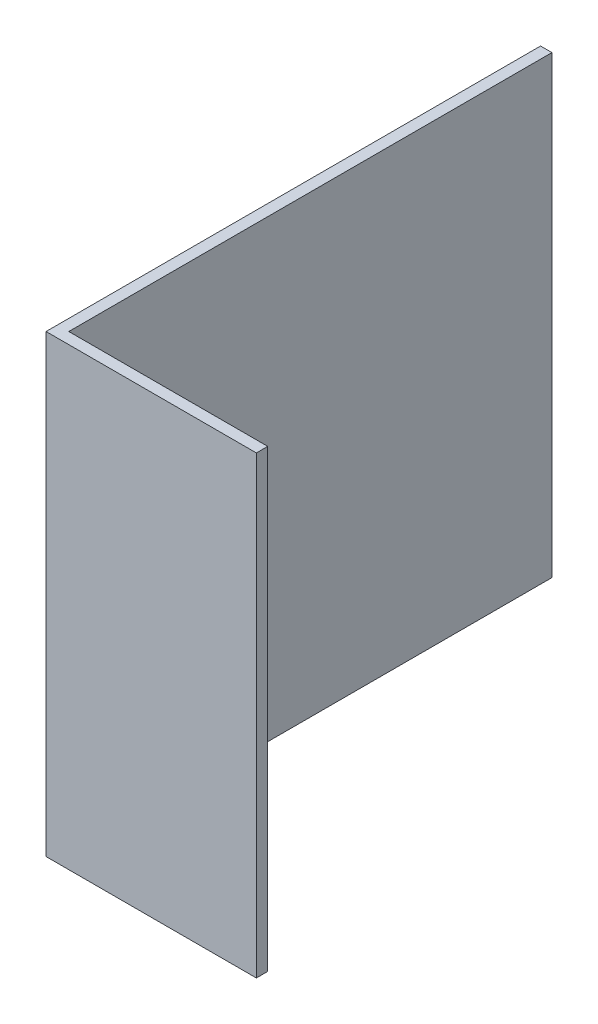
ISO-10303-21;
HEADER;
FILE_DESCRIPTION(('STEP AP214'),'2;1');
FILE_NAME('part.step','',(''),(''),'','','');
FILE_SCHEMA(('AUTOMOTIVE_DESIGN { 1 0 10303 214 1 1 1 1 }'));
ENDSEC;
DATA;
#1=APPLICATION_CONTEXT('core data for automotive mechanical design processes');
#2=APPLICATION_PROTOCOL_DEFINITION('international standard','automotive_design',2000,#1);
#3=PRODUCT_CONTEXT('',#1,'mechanical');
#4=PRODUCT('Part','Part','',(#3));
#5=PRODUCT_RELATED_PRODUCT_CATEGORY('part','',(#4));
#6=PRODUCT_DEFINITION_FORMATION('','',#4);
#7=PRODUCT_DEFINITION_CONTEXT('part definition',#1,'design');
#8=PRODUCT_DEFINITION('design','',#6,#7);
#9=PRODUCT_DEFINITION_SHAPE('','',#8);
#10=(LENGTH_UNIT() NAMED_UNIT(*) SI_UNIT(.MILLI.,.METRE.));
#11=(NAMED_UNIT(*) PLANE_ANGLE_UNIT() SI_UNIT($,.RADIAN.));
#12=(NAMED_UNIT(*) SI_UNIT($,.STERADIAN.) SOLID_ANGLE_UNIT());
#13=UNCERTAINTY_MEASURE_WITH_UNIT(LENGTH_MEASURE(1.E-05),#10,'distance_accuracy_value','');
#14=(GEOMETRIC_REPRESENTATION_CONTEXT(3) GLOBAL_UNCERTAINTY_ASSIGNED_CONTEXT((#13)) GLOBAL_UNIT_ASSIGNED_CONTEXT((#10,
#11,#12)) REPRESENTATION_CONTEXT('',''));
#15=CARTESIAN_POINT('',(0.,0.,0.));
#16=DIRECTION('',(0.,0.,1.));
#17=DIRECTION('',(1.,0.,0.));
#18=AXIS2_PLACEMENT_3D('',#15,#16,#17);
#19=CARTESIAN_POINT('',(0.,40.,0.));
#20=DIRECTION('',(-1.,0.,0.));
#21=DIRECTION('',(0.,0.,1.));
#22=AXIS2_PLACEMENT_3D('',#19,#20,#21);
#23=PLANE('',#22);
#24=DIRECTION('',(0.,1.,0.));
#25=VECTOR('',#24,1.);
#26=CARTESIAN_POINT('',(0.,-40.,-2.));
#27=LINE('',#26,#25);
#28=CARTESIAN_POINT('',(0.,-40.,-2.));
#29=VERTEX_POINT('',#28);
#30=CARTESIAN_POINT('',(0.,40.,-2.));
#31=VERTEX_POINT('',#30);
#32=EDGE_CURVE('E54',#29,#31,#27,.T.);
#33=ORIENTED_EDGE('',*,*,#32,.F.);
#34=DIRECTION('',(0.,0.,-1.));
#35=VECTOR('',#34,1.);
#36=CARTESIAN_POINT('',(0.,-40.,0.));
#37=LINE('',#36,#35);
#38=CARTESIAN_POINT('',(0.,-40.,-87.));
#39=VERTEX_POINT('',#38);
#40=EDGE_CURVE('E107',#29,#39,#37,.T.);
#41=ORIENTED_EDGE('',*,*,#40,.T.);
#42=DIRECTION('',(0.,-1.,0.));
#43=VECTOR('',#42,1.);
#44=CARTESIAN_POINT('',(0.,40.,-87.));
#45=LINE('',#44,#43);
#46=CARTESIAN_POINT('',(0.,40.,-87.));
#47=VERTEX_POINT('',#46);
#48=EDGE_CURVE('E11',#47,#39,#45,.T.);
#49=ORIENTED_EDGE('',*,*,#48,.F.);
#50=DIRECTION('',(0.,0.,-1.));
#51=VECTOR('',#50,1.);
#52=CARTESIAN_POINT('',(0.,40.,0.));
#53=LINE('',#52,#51);
#54=EDGE_CURVE('E83',#31,#47,#53,.T.);
#55=ORIENTED_EDGE('',*,*,#54,.F.);
#56=EDGE_LOOP('',(#33,#41,#49,#55));
#57=FACE_BOUND('',#56,.T.);
#58=ADVANCED_FACE('F37',(#57),#23,.F.);
#59=CARTESIAN_POINT('',(-2.,40.,0.));
#60=DIRECTION('',(0.,0.,-1.));
#61=DIRECTION('',(-1.,0.,0.));
#62=AXIS2_PLACEMENT_3D('',#59,#60,#61);
#63=PLANE('',#62);
#64=DIRECTION('',(1.,0.,0.));
#65=VECTOR('',#64,1.);
#66=CARTESIAN_POINT('',(-2.,-40.,0.));
#67=LINE('',#66,#65);
#68=CARTESIAN_POINT('',(-2.,-40.,0.));
#69=VERTEX_POINT('',#68);
#70=CARTESIAN_POINT('',(35.,-40.,0.));
#71=VERTEX_POINT('',#70);
#72=EDGE_CURVE('E100',#69,#71,#67,.T.);
#73=ORIENTED_EDGE('',*,*,#72,.T.);
#74=DIRECTION('',(0.,-1.,0.));
#75=VECTOR('',#74,1.);
#76=CARTESIAN_POINT('',(35.,40.,0.));
#77=LINE('',#76,#75);
#78=CARTESIAN_POINT('',(35.,40.,0.));
#79=VERTEX_POINT('',#78);
#80=EDGE_CURVE('E104',#79,#71,#77,.T.);
#81=ORIENTED_EDGE('',*,*,#80,.F.);
#82=DIRECTION('',(1.,0.,0.));
#83=VECTOR('',#82,1.);
#84=CARTESIAN_POINT('',(-2.,40.,0.));
#85=LINE('',#84,#83);
#86=CARTESIAN_POINT('',(-2.,40.,0.));
#87=VERTEX_POINT('',#86);
#88=EDGE_CURVE('E130',#87,#79,#85,.T.);
#89=ORIENTED_EDGE('',*,*,#88,.F.);
#90=DIRECTION('',(0.,-1.,0.));
#91=VECTOR('',#90,1.);
#92=CARTESIAN_POINT('',(-2.,40.,0.));
#93=LINE('',#92,#91);
#94=EDGE_CURVE('E105',#87,#69,#93,.T.);
#95=ORIENTED_EDGE('',*,*,#94,.T.);
#96=EDGE_LOOP('',(#73,#81,#89,#95));
#97=FACE_BOUND('',#96,.T.);
#98=ADVANCED_FACE('F39',(#97),#63,.F.);
#99=CARTESIAN_POINT('',(0.,40.,-87.));
#100=DIRECTION('',(0.,0.,1.));
#101=DIRECTION('',(1.,0.,0.));
#102=AXIS2_PLACEMENT_3D('',#99,#100,#101);
#103=PLANE('',#102);
#104=DIRECTION('',(-1.,0.,0.));
#105=VECTOR('',#104,1.);
#106=CARTESIAN_POINT('',(0.,-40.,-87.));
#107=LINE('',#106,#105);
#108=CARTESIAN_POINT('',(-2.00000000000001,-40.,-87.));
#109=VERTEX_POINT('',#108);
#110=EDGE_CURVE('E142',#39,#109,#107,.T.);
#111=ORIENTED_EDGE('',*,*,#110,.T.);
#112=DIRECTION('',(0.,-1.,0.));
#113=VECTOR('',#112,1.);
#114=CARTESIAN_POINT('',(-2.00000000000001,40.,-87.));
#115=LINE('',#114,#113);
#116=CARTESIAN_POINT('',(-2.00000000000001,40.,-87.));
#117=VERTEX_POINT('',#116);
#118=EDGE_CURVE('E46',#117,#109,#115,.T.);
#119=ORIENTED_EDGE('',*,*,#118,.F.);
#120=DIRECTION('',(-1.,0.,0.));
#121=VECTOR('',#120,1.);
#122=CARTESIAN_POINT('',(0.,40.,-87.));
#123=LINE('',#122,#121);
#124=EDGE_CURVE('E141',#47,#117,#123,.T.);
#125=ORIENTED_EDGE('',*,*,#124,.F.);
#126=ORIENTED_EDGE('',*,*,#48,.T.);
#127=EDGE_LOOP('',(#111,#119,#125,#126));
#128=FACE_BOUND('',#127,.T.);
#129=ADVANCED_FACE('F155',(#128),#103,.F.);
#130=CARTESIAN_POINT('',(-2.00000000000001,40.,-87.));
#131=DIRECTION('',(1.,0.,0.));
#132=DIRECTION('',(0.,0.,-1.));
#133=AXIS2_PLACEMENT_3D('',#130,#131,#132);
#134=PLANE('',#133);
#135=DIRECTION('',(0.,0.,1.));
#136=VECTOR('',#135,1.);
#137=CARTESIAN_POINT('',(-2.00000000000001,-40.,-87.));
#138=LINE('',#137,#136);
#139=EDGE_CURVE('E79',#109,#69,#138,.T.);
#140=ORIENTED_EDGE('',*,*,#139,.T.);
#141=ORIENTED_EDGE('',*,*,#94,.F.);
#142=DIRECTION('',(0.,0.,1.));
#143=VECTOR('',#142,1.);
#144=CARTESIAN_POINT('',(-2.00000000000001,40.,-87.));
#145=LINE('',#144,#143);
#146=EDGE_CURVE('E63',#117,#87,#145,.T.);
#147=ORIENTED_EDGE('',*,*,#146,.F.);
#148=ORIENTED_EDGE('',*,*,#118,.T.);
#149=EDGE_LOOP('',(#140,#141,#147,#148));
#150=FACE_BOUND('',#149,.T.);
#151=ADVANCED_FACE('F157',(#150),#134,.F.);
#152=CARTESIAN_POINT('',(0.,40.,0.));
#153=DIRECTION('',(0.,1.,0.));
#154=DIRECTION('',(0.,0.,1.));
#155=AXIS2_PLACEMENT_3D('',#152,#153,#154);
#156=PLANE('',#155);
#157=ORIENTED_EDGE('',*,*,#88,.T.);
#158=DIRECTION('',(0.,0.,1.));
#159=VECTOR('',#158,1.);
#160=CARTESIAN_POINT('',(35.,40.,-2.));
#161=LINE('',#160,#159);
#162=CARTESIAN_POINT('',(35.,40.,-2.));
#163=VERTEX_POINT('',#162);
#164=EDGE_CURVE('E121',#163,#79,#161,.T.);
#165=ORIENTED_EDGE('',*,*,#164,.F.);
#166=DIRECTION('',(-1.,0.,0.));
#167=VECTOR('',#166,1.);
#168=CARTESIAN_POINT('',(35.,40.,-2.));
#169=LINE('',#168,#167);
#170=EDGE_CURVE('E127',#163,#31,#169,.T.);
#171=ORIENTED_EDGE('',*,*,#170,.T.);
#172=ORIENTED_EDGE('',*,*,#54,.T.);
#173=ORIENTED_EDGE('',*,*,#124,.T.);
#174=ORIENTED_EDGE('',*,*,#146,.T.);
#175=EDGE_LOOP('',(#157,#165,#171,#172,#173,#174));
#176=FACE_BOUND('',#175,.T.);
#177=ADVANCED_FACE('F140',(#176),#156,.T.);
#178=CARTESIAN_POINT('',(0.,-40.,0.));
#179=DIRECTION('',(0.,1.,0.));
#180=DIRECTION('',(0.,0.,1.));
#181=AXIS2_PLACEMENT_3D('',#178,#179,#180);
#182=PLANE('',#181);
#183=ORIENTED_EDGE('',*,*,#72,.F.);
#184=ORIENTED_EDGE('',*,*,#139,.F.);
#185=ORIENTED_EDGE('',*,*,#110,.F.);
#186=ORIENTED_EDGE('',*,*,#40,.F.);
#187=DIRECTION('',(-1.,0.,0.));
#188=VECTOR('',#187,1.);
#189=CARTESIAN_POINT('',(35.,-40.,-2.));
#190=LINE('',#189,#188);
#191=CARTESIAN_POINT('',(35.,-40.,-2.));
#192=VERTEX_POINT('',#191);
#193=EDGE_CURVE('E108',#192,#29,#190,.T.);
#194=ORIENTED_EDGE('',*,*,#193,.F.);
#195=DIRECTION('',(0.,0.,-1.));
#196=VECTOR('',#195,1.);
#197=CARTESIAN_POINT('',(35.,-40.,0.));
#198=LINE('',#197,#196);
#199=EDGE_CURVE('E111',#71,#192,#198,.T.);
#200=ORIENTED_EDGE('',*,*,#199,.F.);
#201=EDGE_LOOP('',(#183,#184,#185,#186,#194,#200));
#202=FACE_BOUND('',#201,.T.);
#203=ADVANCED_FACE('F112',(#202),#182,.F.);
#204=CARTESIAN_POINT('',(35.,-40.,-2.));
#205=DIRECTION('',(0.,0.,1.));
#206=DIRECTION('',(1.,0.,0.));
#207=AXIS2_PLACEMENT_3D('',#204,#205,#206);
#208=PLANE('',#207);
#209=ORIENTED_EDGE('',*,*,#32,.T.);
#210=ORIENTED_EDGE('',*,*,#170,.F.);
#211=DIRECTION('',(0.,1.,0.));
#212=VECTOR('',#211,1.);
#213=CARTESIAN_POINT('',(35.,-40.,-2.));
#214=LINE('',#213,#212);
#215=EDGE_CURVE('E116',#192,#163,#214,.T.);
#216=ORIENTED_EDGE('',*,*,#215,.F.);
#217=ORIENTED_EDGE('',*,*,#193,.T.);
#218=EDGE_LOOP('',(#209,#210,#216,#217));
#219=FACE_BOUND('',#218,.T.);
#220=ADVANCED_FACE('F138',(#219),#208,.F.);
#221=CARTESIAN_POINT('',(35.,0.,0.));
#222=DIRECTION('',(1.,0.,0.));
#223=DIRECTION('',(0.,0.,-1.));
#224=AXIS2_PLACEMENT_3D('',#221,#222,#223);
#225=PLANE('',#224);
#226=ORIENTED_EDGE('',*,*,#80,.T.);
#227=ORIENTED_EDGE('',*,*,#199,.T.);
#228=ORIENTED_EDGE('',*,*,#215,.T.);
#229=ORIENTED_EDGE('',*,*,#164,.T.);
#230=EDGE_LOOP('',(#226,#227,#228,#229));
#231=FACE_BOUND('',#230,.T.);
#232=ADVANCED_FACE('F119',(#231),#225,.T.);
#233=CLOSED_SHELL('',(#58,#98,#129,#151,#177,#203,#220,#232));
#234=MANIFOLD_SOLID_BREP('B2',#233);
#235=ADVANCED_BREP_SHAPE_REPRESENTATION('',(#18,#234),#14);
#236=SHAPE_DEFINITION_REPRESENTATION(#9,#235);
ENDSEC;
END-ISO-10303-21;
